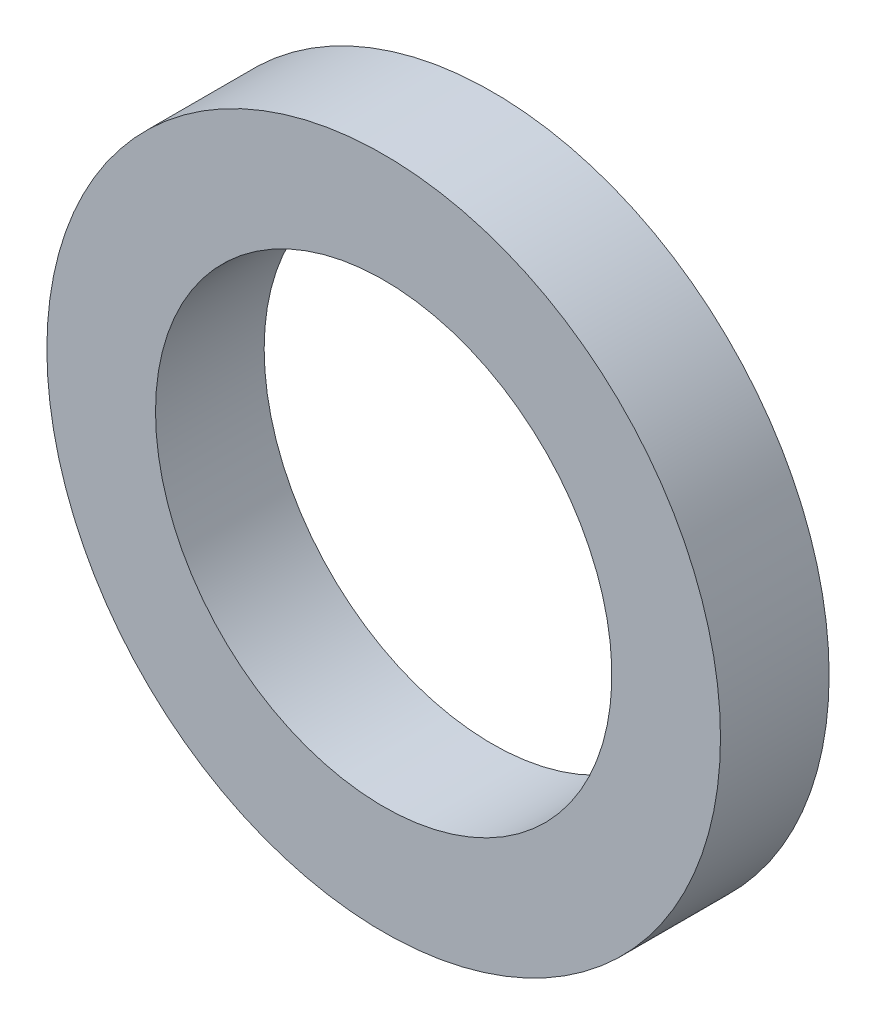
ISO-10303-21;
HEADER;
FILE_DESCRIPTION(('STEP AP214'),'2;1');
FILE_NAME('part.step','',(''),(''),'','','');
FILE_SCHEMA(('AUTOMOTIVE_DESIGN { 1 0 10303 214 1 1 1 1 }'));
ENDSEC;
DATA;
#1=APPLICATION_CONTEXT('core data for automotive mechanical design processes');
#2=APPLICATION_PROTOCOL_DEFINITION('international standard','automotive_design',2000,#1);
#3=PRODUCT_CONTEXT('',#1,'mechanical');
#4=PRODUCT('Part','Part','',(#3));
#5=PRODUCT_RELATED_PRODUCT_CATEGORY('part','',(#4));
#6=PRODUCT_DEFINITION_FORMATION('','',#4);
#7=PRODUCT_DEFINITION_CONTEXT('part definition',#1,'design');
#8=PRODUCT_DEFINITION('design','',#6,#7);
#9=PRODUCT_DEFINITION_SHAPE('','',#8);
#10=(LENGTH_UNIT() NAMED_UNIT(*) SI_UNIT(.MILLI.,.METRE.));
#11=(NAMED_UNIT(*) PLANE_ANGLE_UNIT() SI_UNIT($,.RADIAN.));
#12=(NAMED_UNIT(*) SI_UNIT($,.STERADIAN.) SOLID_ANGLE_UNIT());
#13=UNCERTAINTY_MEASURE_WITH_UNIT(LENGTH_MEASURE(1.E-05),#10,'distance_accuracy_value','');
#14=(GEOMETRIC_REPRESENTATION_CONTEXT(3) GLOBAL_UNCERTAINTY_ASSIGNED_CONTEXT((#13)) GLOBAL_UNIT_ASSIGNED_CONTEXT((#10,
#11,#12)) REPRESENTATION_CONTEXT('',''));
#15=CARTESIAN_POINT('',(0.,0.,0.));
#16=DIRECTION('',(0.,0.,1.));
#17=DIRECTION('',(1.,0.,0.));
#18=AXIS2_PLACEMENT_3D('',#15,#16,#17);
#19=CARTESIAN_POINT('',(0.,0.,1.));
#20=DIRECTION('',(0.,0.,-1.));
#21=DIRECTION('',(-1.,0.,0.));
#22=AXIS2_PLACEMENT_3D('',#19,#20,#21);
#23=CYLINDRICAL_SURFACE('',#22,3.1);
#24=CARTESIAN_POINT('',(0.,0.,1.));
#25=DIRECTION('',(0.,0.,1.));
#26=DIRECTION('',(1.,0.,0.));
#27=AXIS2_PLACEMENT_3D('',#24,#25,#26);
#28=CIRCLE('',#27,3.1);
#29=CARTESIAN_POINT('',(3.1,0.,1.));
#30=VERTEX_POINT('',#29);
#31=EDGE_CURVE('E10',#30,#30,#28,.T.);
#32=ORIENTED_EDGE('',*,*,#31,.F.);
#33=EDGE_LOOP('',(#32));
#34=FACE_BOUND('',#33,.T.);
#35=CARTESIAN_POINT('',(0.,0.,0.));
#36=DIRECTION('',(0.,0.,1.));
#37=DIRECTION('',(1.,0.,0.));
#38=AXIS2_PLACEMENT_3D('',#35,#36,#37);
#39=CIRCLE('',#38,3.1);
#40=CARTESIAN_POINT('',(3.1,0.,0.));
#41=VERTEX_POINT('',#40);
#42=EDGE_CURVE('E37',#41,#41,#39,.T.);
#43=ORIENTED_EDGE('',*,*,#42,.T.);
#44=EDGE_LOOP('',(#43));
#45=FACE_BOUND('',#44,.T.);
#46=ADVANCED_FACE('F34',(#34,#45),#23,.T.);
#47=CARTESIAN_POINT('',(0.,0.,1.));
#48=DIRECTION('',(0.,0.,1.));
#49=DIRECTION('',(1.,0.,0.));
#50=AXIS2_PLACEMENT_3D('',#47,#48,#49);
#51=PLANE('',#50);
#52=CARTESIAN_POINT('',(0.,0.,1.));
#53=DIRECTION('',(0.,0.,-1.));
#54=DIRECTION('',(-1.,0.,0.));
#55=AXIS2_PLACEMENT_3D('',#52,#53,#54);
#56=CIRCLE('',#55,2.1);
#57=CARTESIAN_POINT('',(-2.1,0.,1.));
#58=VERTEX_POINT('',#57);
#59=EDGE_CURVE('E44',#58,#58,#56,.T.);
#60=ORIENTED_EDGE('',*,*,#59,.T.);
#61=EDGE_LOOP('',(#60));
#62=FACE_BOUND('',#61,.T.);
#63=ORIENTED_EDGE('',*,*,#31,.T.);
#64=EDGE_LOOP('',(#63));
#65=FACE_BOUND('',#64,.T.);
#66=ADVANCED_FACE('F52',(#62,#65),#51,.T.);
#67=CARTESIAN_POINT('',(0.,0.,0.));
#68=DIRECTION('',(0.,0.,1.));
#69=DIRECTION('',(1.,0.,0.));
#70=AXIS2_PLACEMENT_3D('',#67,#68,#69);
#71=PLANE('',#70);
#72=CARTESIAN_POINT('',(0.,0.,0.));
#73=DIRECTION('',(0.,0.,-1.));
#74=DIRECTION('',(-1.,0.,0.));
#75=AXIS2_PLACEMENT_3D('',#72,#73,#74);
#76=CIRCLE('',#75,2.1);
#77=CARTESIAN_POINT('',(-2.1,0.,0.));
#78=VERTEX_POINT('',#77);
#79=EDGE_CURVE('E46',#78,#78,#76,.T.);
#80=ORIENTED_EDGE('',*,*,#79,.F.);
#81=EDGE_LOOP('',(#80));
#82=FACE_BOUND('',#81,.T.);
#83=ORIENTED_EDGE('',*,*,#42,.F.);
#84=EDGE_LOOP('',(#83));
#85=FACE_BOUND('',#84,.T.);
#86=ADVANCED_FACE('F57',(#82,#85),#71,.F.);
#87=CARTESIAN_POINT('',(0.,0.,1.));
#88=DIRECTION('',(0.,0.,-1.));
#89=DIRECTION('',(-1.,0.,0.));
#90=AXIS2_PLACEMENT_3D('',#87,#88,#89);
#91=CYLINDRICAL_SURFACE('',#90,2.1);
#92=ORIENTED_EDGE('',*,*,#59,.F.);
#93=EDGE_LOOP('',(#92));
#94=FACE_BOUND('',#93,.T.);
#95=ORIENTED_EDGE('',*,*,#79,.T.);
#96=EDGE_LOOP('',(#95));
#97=FACE_BOUND('',#96,.T.);
#98=ADVANCED_FACE('F54',(#94,#97),#91,.F.);
#99=CLOSED_SHELL('',(#46,#66,#86,#98));
#100=MANIFOLD_SOLID_BREP('B2',#99);
#101=ADVANCED_BREP_SHAPE_REPRESENTATION('',(#18,#100),#14);
#102=SHAPE_DEFINITION_REPRESENTATION(#9,#101);
ENDSEC;
END-ISO-10303-21;
